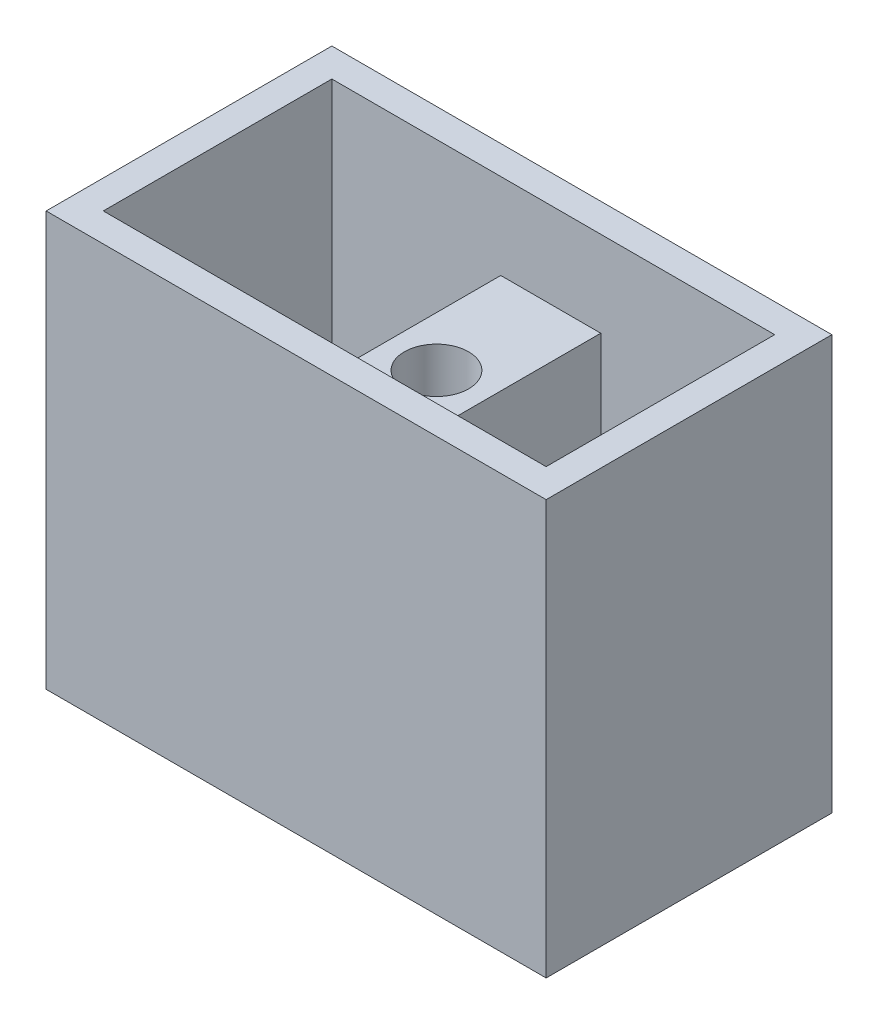
ISO-10303-21;
HEADER;
FILE_DESCRIPTION(('STEP AP214'),'2;1');
FILE_NAME('part.step','',(''),(''),'','','');
FILE_SCHEMA(('AUTOMOTIVE_DESIGN { 1 0 10303 214 1 1 1 1 }'));
ENDSEC;
DATA;
#1=APPLICATION_CONTEXT('core data for automotive mechanical design processes');
#2=APPLICATION_PROTOCOL_DEFINITION('international standard','automotive_design',2000,#1);
#3=PRODUCT_CONTEXT('',#1,'mechanical');
#4=PRODUCT('Part','Part','',(#3));
#5=PRODUCT_RELATED_PRODUCT_CATEGORY('part','',(#4));
#6=PRODUCT_DEFINITION_FORMATION('','',#4);
#7=PRODUCT_DEFINITION_CONTEXT('part definition',#1,'design');
#8=PRODUCT_DEFINITION('design','',#6,#7);
#9=PRODUCT_DEFINITION_SHAPE('','',#8);
#10=(LENGTH_UNIT() NAMED_UNIT(*) SI_UNIT(.MILLI.,.METRE.));
#11=(NAMED_UNIT(*) PLANE_ANGLE_UNIT() SI_UNIT($,.RADIAN.));
#12=(NAMED_UNIT(*) SI_UNIT($,.STERADIAN.) SOLID_ANGLE_UNIT());
#13=UNCERTAINTY_MEASURE_WITH_UNIT(LENGTH_MEASURE(1.E-05),#10,'distance_accuracy_value','');
#14=(GEOMETRIC_REPRESENTATION_CONTEXT(3) GLOBAL_UNCERTAINTY_ASSIGNED_CONTEXT((#13)) GLOBAL_UNIT_ASSIGNED_CONTEXT((#10,
#11,#12)) REPRESENTATION_CONTEXT('',''));
#15=CARTESIAN_POINT('',(0.,0.,0.));
#16=DIRECTION('',(0.,0.,1.));
#17=DIRECTION('',(1.,0.,0.));
#18=AXIS2_PLACEMENT_3D('',#15,#16,#17);
#19=CARTESIAN_POINT('',(69.1132816727556,0.,-90.));
#20=DIRECTION('',(1.,0.,0.));
#21=DIRECTION('',(0.,0.,-1.));
#22=AXIS2_PLACEMENT_3D('',#19,#20,#21);
#23=PLANE('',#22);
#24=DIRECTION('',(0.,0.,-1.));
#25=VECTOR('',#24,1.);
#26=CARTESIAN_POINT('',(69.1132816727556,30.,-10.));
#27=LINE('',#26,#25);
#28=CARTESIAN_POINT('',(69.1132816727556,30.,-10.));
#29=VERTEX_POINT('',#28);
#30=CARTESIAN_POINT('',(69.1132816727556,30.,-90.));
#31=VERTEX_POINT('',#30);
#32=EDGE_CURVE('E133',#29,#31,#27,.T.);
#33=ORIENTED_EDGE('',*,*,#32,.F.);
#34=DIRECTION('',(0.,1.,0.));
#35=VECTOR('',#34,1.);
#36=CARTESIAN_POINT('',(69.1132816727556,0.,-10.));
#37=LINE('',#36,#35);
#38=CARTESIAN_POINT('',(69.1132816727556,115.,-10.));
#39=VERTEX_POINT('',#38);
#40=EDGE_CURVE('E144',#29,#39,#37,.T.);
#41=ORIENTED_EDGE('',*,*,#40,.T.);
#42=DIRECTION('',(0.,0.,1.));
#43=VECTOR('',#42,1.);
#44=CARTESIAN_POINT('',(69.1132816727556,115.,-90.));
#45=LINE('',#44,#43);
#46=CARTESIAN_POINT('',(69.1132816727556,115.,-90.));
#47=VERTEX_POINT('',#46);
#48=EDGE_CURVE('E142',#47,#39,#45,.T.);
#49=ORIENTED_EDGE('',*,*,#48,.F.);
#50=DIRECTION('',(0.,1.,0.));
#51=VECTOR('',#50,1.);
#52=CARTESIAN_POINT('',(69.1132816727556,0.,-90.));
#53=LINE('',#52,#51);
#54=EDGE_CURVE('E127',#31,#47,#53,.T.);
#55=ORIENTED_EDGE('',*,*,#54,.F.);
#56=EDGE_LOOP('',(#33,#41,#49,#55));
#57=FACE_BOUND('',#56,.T.);
#58=ADVANCED_FACE('F33',(#57),#23,.F.);
#59=CARTESIAN_POINT('',(86.6132816727556,0.,-50.));
#60=DIRECTION('',(0.,1.,0.));
#61=DIRECTION('',(0.,0.,1.));
#62=AXIS2_PLACEMENT_3D('',#59,#60,#61);
#63=CYLINDRICAL_SURFACE('',#62,11.25);
#64=CARTESIAN_POINT('',(86.6132816727556,115.,-50.));
#65=DIRECTION('',(0.,1.,0.));
#66=DIRECTION('',(0.,0.,1.));
#67=AXIS2_PLACEMENT_3D('',#64,#65,#66);
#68=CIRCLE('',#67,11.25);
#69=CARTESIAN_POINT('',(86.6132816727556,115.,-38.75));
#70=VERTEX_POINT('',#69);
#71=EDGE_CURVE('E365',#70,#70,#68,.F.);
#72=ORIENTED_EDGE('',*,*,#71,.F.);
#73=EDGE_LOOP('',(#72));
#74=FACE_BOUND('',#73,.T.);
#75=CARTESIAN_POINT('',(86.6132816727556,30.,-50.));
#76=DIRECTION('',(0.,-1.,0.));
#77=DIRECTION('',(0.,0.,-1.));
#78=AXIS2_PLACEMENT_3D('',#75,#76,#77);
#79=CIRCLE('',#78,11.25);
#80=CARTESIAN_POINT('',(86.6132816727556,30.,-61.25));
#81=VERTEX_POINT('',#80);
#82=EDGE_CURVE('E353',#81,#81,#79,.F.);
#83=ORIENTED_EDGE('',*,*,#82,.F.);
#84=EDGE_LOOP('',(#83));
#85=FACE_BOUND('',#84,.T.);
#86=ADVANCED_FACE('F209',(#74,#85),#63,.F.);
#87=CARTESIAN_POINT('',(104.113281672756,0.,-90.));
#88=DIRECTION('',(-1.,0.,0.));
#89=DIRECTION('',(0.,0.,1.));
#90=AXIS2_PLACEMENT_3D('',#87,#88,#89);
#91=PLANE('',#90);
#92=DIRECTION('',(0.,0.,1.));
#93=VECTOR('',#92,1.);
#94=CARTESIAN_POINT('',(104.113281672756,30.,-10.));
#95=LINE('',#94,#93);
#96=CARTESIAN_POINT('',(104.113281672756,30.,-90.));
#97=VERTEX_POINT('',#96);
#98=CARTESIAN_POINT('',(104.113281672756,30.,-10.));
#99=VERTEX_POINT('',#98);
#100=EDGE_CURVE('E132',#97,#99,#95,.T.);
#101=ORIENTED_EDGE('',*,*,#100,.F.);
#102=DIRECTION('',(0.,1.,0.));
#103=VECTOR('',#102,1.);
#104=CARTESIAN_POINT('',(104.113281672756,0.,-90.));
#105=LINE('',#104,#103);
#106=CARTESIAN_POINT('',(104.113281672756,115.,-90.));
#107=VERTEX_POINT('',#106);
#108=EDGE_CURVE('E129',#97,#107,#105,.T.);
#109=ORIENTED_EDGE('',*,*,#108,.T.);
#110=DIRECTION('',(0.,0.,-1.));
#111=VECTOR('',#110,1.);
#112=CARTESIAN_POINT('',(104.113281672756,115.,-90.));
#113=LINE('',#112,#111);
#114=CARTESIAN_POINT('',(104.113281672756,115.,-10.));
#115=VERTEX_POINT('',#114);
#116=EDGE_CURVE('E361',#115,#107,#113,.T.);
#117=ORIENTED_EDGE('',*,*,#116,.F.);
#118=DIRECTION('',(0.,1.,0.));
#119=VECTOR('',#118,1.);
#120=CARTESIAN_POINT('',(104.113281672756,0.,-10.));
#121=LINE('',#120,#119);
#122=EDGE_CURVE('E53',#99,#115,#121,.T.);
#123=ORIENTED_EDGE('',*,*,#122,.F.);
#124=EDGE_LOOP('',(#101,#109,#117,#123));
#125=FACE_BOUND('',#124,.T.);
#126=ADVANCED_FACE('F207',(#125),#91,.F.);
#127=CARTESIAN_POINT('',(0.,145.,0.));
#128=DIRECTION('',(1.,0.,0.));
#129=DIRECTION('',(0.,0.,-1.));
#130=AXIS2_PLACEMENT_3D('',#127,#128,#129);
#131=PLANE('',#130);
#132=DIRECTION('',(0.,0.,1.));
#133=VECTOR('',#132,1.);
#134=CARTESIAN_POINT('',(0.,0.,0.));
#135=LINE('',#134,#133);
#136=CARTESIAN_POINT('',(0.,0.,-100.));
#137=VERTEX_POINT('',#136);
#138=CARTESIAN_POINT('',(0.,0.,0.));
#139=VERTEX_POINT('',#138);
#140=EDGE_CURVE('E143',#137,#139,#135,.T.);
#141=ORIENTED_EDGE('',*,*,#140,.T.);
#142=DIRECTION('',(0.,-1.,0.));
#143=VECTOR('',#142,1.);
#144=CARTESIAN_POINT('',(0.,145.,0.));
#145=LINE('',#144,#143);
#146=CARTESIAN_POINT('',(0.,145.,0.));
#147=VERTEX_POINT('',#146);
#148=EDGE_CURVE('E11',#147,#139,#145,.T.);
#149=ORIENTED_EDGE('',*,*,#148,.F.);
#150=DIRECTION('',(0.,0.,1.));
#151=VECTOR('',#150,1.);
#152=CARTESIAN_POINT('',(0.,145.,0.));
#153=LINE('',#152,#151);
#154=CARTESIAN_POINT('',(0.,145.,-100.));
#155=VERTEX_POINT('',#154);
#156=EDGE_CURVE('E160',#155,#147,#153,.T.);
#157=ORIENTED_EDGE('',*,*,#156,.F.);
#158=DIRECTION('',(0.,-1.,0.));
#159=VECTOR('',#158,1.);
#160=CARTESIAN_POINT('',(0.,145.,-100.));
#161=LINE('',#160,#159);
#162=EDGE_CURVE('E169',#155,#137,#161,.T.);
#163=ORIENTED_EDGE('',*,*,#162,.T.);
#164=EDGE_LOOP('',(#141,#149,#157,#163));
#165=FACE_BOUND('',#164,.T.);
#166=ADVANCED_FACE('F35',(#165),#131,.F.);
#167=CARTESIAN_POINT('',(0.,145.,0.));
#168=DIRECTION('',(0.,0.,-1.));
#169=DIRECTION('',(-1.,0.,0.));
#170=AXIS2_PLACEMENT_3D('',#167,#168,#169);
#171=PLANE('',#170);
#172=DIRECTION('',(1.,0.,0.));
#173=VECTOR('',#172,1.);
#174=CARTESIAN_POINT('',(0.,0.,0.));
#175=LINE('',#174,#173);
#176=CARTESIAN_POINT('',(175.,0.,0.));
#177=VERTEX_POINT('',#176);
#178=EDGE_CURVE('E147',#139,#177,#175,.T.);
#179=ORIENTED_EDGE('',*,*,#178,.T.);
#180=DIRECTION('',(0.,-1.,0.));
#181=VECTOR('',#180,1.);
#182=CARTESIAN_POINT('',(175.,145.,0.));
#183=LINE('',#182,#181);
#184=CARTESIAN_POINT('',(175.,145.,0.));
#185=VERTEX_POINT('',#184);
#186=EDGE_CURVE('E41',#185,#177,#183,.T.);
#187=ORIENTED_EDGE('',*,*,#186,.F.);
#188=DIRECTION('',(1.,0.,0.));
#189=VECTOR('',#188,1.);
#190=CARTESIAN_POINT('',(0.,145.,0.));
#191=LINE('',#190,#189);
#192=EDGE_CURVE('E163',#147,#185,#191,.T.);
#193=ORIENTED_EDGE('',*,*,#192,.F.);
#194=ORIENTED_EDGE('',*,*,#148,.T.);
#195=EDGE_LOOP('',(#179,#187,#193,#194));
#196=FACE_BOUND('',#195,.T.);
#197=ADVANCED_FACE('F200',(#196),#171,.F.);
#198=CARTESIAN_POINT('',(175.,145.,0.));
#199=DIRECTION('',(-1.,0.,0.));
#200=DIRECTION('',(0.,0.,1.));
#201=AXIS2_PLACEMENT_3D('',#198,#199,#200);
#202=PLANE('',#201);
#203=DIRECTION('',(0.,0.,-1.));
#204=VECTOR('',#203,1.);
#205=CARTESIAN_POINT('',(175.,0.,0.));
#206=LINE('',#205,#204);
#207=CARTESIAN_POINT('',(175.,0.,-100.));
#208=VERTEX_POINT('',#207);
#209=EDGE_CURVE('E172',#177,#208,#206,.T.);
#210=ORIENTED_EDGE('',*,*,#209,.T.);
#211=DIRECTION('',(0.,-1.,0.));
#212=VECTOR('',#211,1.);
#213=CARTESIAN_POINT('',(175.,145.,-100.));
#214=LINE('',#213,#212);
#215=CARTESIAN_POINT('',(175.,145.,-100.));
#216=VERTEX_POINT('',#215);
#217=EDGE_CURVE('E177',#216,#208,#214,.T.);
#218=ORIENTED_EDGE('',*,*,#217,.F.);
#219=DIRECTION('',(0.,0.,-1.));
#220=VECTOR('',#219,1.);
#221=CARTESIAN_POINT('',(175.,145.,0.));
#222=LINE('',#221,#220);
#223=EDGE_CURVE('E166',#185,#216,#222,.T.);
#224=ORIENTED_EDGE('',*,*,#223,.F.);
#225=ORIENTED_EDGE('',*,*,#186,.T.);
#226=EDGE_LOOP('',(#210,#218,#224,#225));
#227=FACE_BOUND('',#226,.T.);
#228=ADVANCED_FACE('F184',(#227),#202,.F.);
#229=CARTESIAN_POINT('',(0.,145.,-100.));
#230=DIRECTION('',(0.,0.,1.));
#231=DIRECTION('',(1.,0.,0.));
#232=AXIS2_PLACEMENT_3D('',#229,#230,#231);
#233=PLANE('',#232);
#234=DIRECTION('',(-1.,0.,0.));
#235=VECTOR('',#234,1.);
#236=CARTESIAN_POINT('',(0.,0.,-100.));
#237=LINE('',#236,#235);
#238=EDGE_CURVE('E164',#208,#137,#237,.T.);
#239=ORIENTED_EDGE('',*,*,#238,.T.);
#240=ORIENTED_EDGE('',*,*,#162,.F.);
#241=DIRECTION('',(-1.,0.,0.));
#242=VECTOR('',#241,1.);
#243=CARTESIAN_POINT('',(0.,145.,-100.));
#244=LINE('',#243,#242);
#245=EDGE_CURVE('E168',#216,#155,#244,.T.);
#246=ORIENTED_EDGE('',*,*,#245,.F.);
#247=ORIENTED_EDGE('',*,*,#217,.T.);
#248=EDGE_LOOP('',(#239,#240,#246,#247));
#249=FACE_BOUND('',#248,.T.);
#250=ADVANCED_FACE('F193',(#249),#233,.F.);
#251=CARTESIAN_POINT('',(0.,145.,0.));
#252=DIRECTION('',(0.,-1.,0.));
#253=DIRECTION('',(0.,0.,-1.));
#254=AXIS2_PLACEMENT_3D('',#251,#252,#253);
#255=PLANE('',#254);
#256=DIRECTION('',(-1.,0.,0.));
#257=VECTOR('',#256,1.);
#258=CARTESIAN_POINT('',(69.1132816727556,145.,-90.));
#259=LINE('',#258,#257);
#260=CARTESIAN_POINT('',(165.,145.,-90.));
#261=VERTEX_POINT('',#260);
#262=CARTESIAN_POINT('',(10.,145.,-90.));
#263=VERTEX_POINT('',#262);
#264=EDGE_CURVE('E377',#261,#263,#259,.T.);
#265=ORIENTED_EDGE('',*,*,#264,.F.);
#266=DIRECTION('',(0.,0.,-1.));
#267=VECTOR('',#266,1.);
#268=CARTESIAN_POINT('',(165.,145.,-10.));
#269=LINE('',#268,#267);
#270=CARTESIAN_POINT('',(165.,145.,-10.));
#271=VERTEX_POINT('',#270);
#272=EDGE_CURVE('E368',#271,#261,#269,.T.);
#273=ORIENTED_EDGE('',*,*,#272,.F.);
#274=DIRECTION('',(1.,0.,0.));
#275=VECTOR('',#274,1.);
#276=CARTESIAN_POINT('',(10.,145.,-10.));
#277=LINE('',#276,#275);
#278=CARTESIAN_POINT('',(10.,145.,-10.));
#279=VERTEX_POINT('',#278);
#280=EDGE_CURVE('E152',#279,#271,#277,.T.);
#281=ORIENTED_EDGE('',*,*,#280,.F.);
#282=DIRECTION('',(0.,0.,1.));
#283=VECTOR('',#282,1.);
#284=CARTESIAN_POINT('',(10.,145.,-90.));
#285=LINE('',#284,#283);
#286=EDGE_CURVE('E390',#263,#279,#285,.T.);
#287=ORIENTED_EDGE('',*,*,#286,.F.);
#288=EDGE_LOOP('',(#265,#273,#281,#287));
#289=FACE_BOUND('',#288,.T.);
#290=ORIENTED_EDGE('',*,*,#156,.T.);
#291=ORIENTED_EDGE('',*,*,#192,.T.);
#292=ORIENTED_EDGE('',*,*,#223,.T.);
#293=ORIENTED_EDGE('',*,*,#245,.T.);
#294=EDGE_LOOP('',(#290,#291,#292,#293));
#295=FACE_BOUND('',#294,.T.);
#296=ADVANCED_FACE('F199',(#289,#295),#255,.F.);
#297=CARTESIAN_POINT('',(0.,0.,0.));
#298=DIRECTION('',(0.,-1.,0.));
#299=DIRECTION('',(0.,0.,-1.));
#300=AXIS2_PLACEMENT_3D('',#297,#298,#299);
#301=PLANE('',#300);
#302=DIRECTION('',(1.,0.,0.));
#303=VECTOR('',#302,1.);
#304=CARTESIAN_POINT('',(10.,0.,-10.));
#305=LINE('',#304,#303);
#306=CARTESIAN_POINT('',(10.,0.,-10.));
#307=VERTEX_POINT('',#306);
#308=CARTESIAN_POINT('',(165.,0.,-10.));
#309=VERTEX_POINT('',#308);
#310=EDGE_CURVE('E159',#307,#309,#305,.T.);
#311=ORIENTED_EDGE('',*,*,#310,.T.);
#312=DIRECTION('',(0.,0.,-1.));
#313=VECTOR('',#312,1.);
#314=CARTESIAN_POINT('',(165.,0.,-10.));
#315=LINE('',#314,#313);
#316=CARTESIAN_POINT('',(165.,0.,-90.));
#317=VERTEX_POINT('',#316);
#318=EDGE_CURVE('E369',#309,#317,#315,.T.);
#319=ORIENTED_EDGE('',*,*,#318,.T.);
#320=DIRECTION('',(-1.,0.,0.));
#321=VECTOR('',#320,1.);
#322=CARTESIAN_POINT('',(69.1132816727556,0.,-90.));
#323=LINE('',#322,#321);
#324=CARTESIAN_POINT('',(10.,0.,-90.));
#325=VERTEX_POINT('',#324);
#326=EDGE_CURVE('E383',#317,#325,#323,.T.);
#327=ORIENTED_EDGE('',*,*,#326,.T.);
#328=DIRECTION('',(0.,0.,1.));
#329=VECTOR('',#328,1.);
#330=CARTESIAN_POINT('',(10.,0.,-90.));
#331=LINE('',#330,#329);
#332=EDGE_CURVE('E386',#325,#307,#331,.T.);
#333=ORIENTED_EDGE('',*,*,#332,.T.);
#334=EDGE_LOOP('',(#311,#319,#327,#333));
#335=FACE_BOUND('',#334,.T.);
#336=ORIENTED_EDGE('',*,*,#140,.F.);
#337=ORIENTED_EDGE('',*,*,#238,.F.);
#338=ORIENTED_EDGE('',*,*,#209,.F.);
#339=ORIENTED_EDGE('',*,*,#178,.F.);
#340=EDGE_LOOP('',(#336,#337,#338,#339));
#341=FACE_BOUND('',#340,.T.);
#342=ADVANCED_FACE('F190',(#335,#341),#301,.T.);
#343=CARTESIAN_POINT('',(69.1132816727556,0.,-90.));
#344=DIRECTION('',(0.,0.,-1.));
#345=DIRECTION('',(-1.,0.,0.));
#346=AXIS2_PLACEMENT_3D('',#343,#344,#345);
#347=PLANE('',#346);
#348=DIRECTION('',(1.,0.,0.));
#349=VECTOR('',#348,1.);
#350=CARTESIAN_POINT('',(69.1132816727556,30.,-90.));
#351=LINE('',#350,#349);
#352=EDGE_CURVE('E121',#31,#97,#351,.T.);
#353=ORIENTED_EDGE('',*,*,#352,.F.);
#354=ORIENTED_EDGE('',*,*,#54,.T.);
#355=DIRECTION('',(-1.,0.,0.));
#356=VECTOR('',#355,1.);
#357=CARTESIAN_POINT('',(69.1132816727556,115.,-90.));
#358=LINE('',#357,#356);
#359=EDGE_CURVE('E363',#107,#47,#358,.T.);
#360=ORIENTED_EDGE('',*,*,#359,.F.);
#361=ORIENTED_EDGE('',*,*,#108,.F.);
#362=EDGE_LOOP('',(#353,#354,#360,#361));
#363=FACE_BOUND('',#362,.T.);
#364=ORIENTED_EDGE('',*,*,#264,.T.);
#365=DIRECTION('',(0.,1.,0.));
#366=VECTOR('',#365,1.);
#367=CARTESIAN_POINT('',(10.,0.,-90.));
#368=LINE('',#367,#366);
#369=EDGE_CURVE('E156',#325,#263,#368,.T.);
#370=ORIENTED_EDGE('',*,*,#369,.F.);
#371=ORIENTED_EDGE('',*,*,#326,.F.);
#372=DIRECTION('',(0.,1.,0.));
#373=VECTOR('',#372,1.);
#374=CARTESIAN_POINT('',(165.,0.,-90.));
#375=LINE('',#374,#373);
#376=EDGE_CURVE('E374',#317,#261,#375,.T.);
#377=ORIENTED_EDGE('',*,*,#376,.T.);
#378=EDGE_LOOP('',(#364,#370,#371,#377));
#379=FACE_BOUND('',#378,.T.);
#380=ADVANCED_FACE('F123',(#363,#379),#347,.F.);
#381=CARTESIAN_POINT('',(10.,0.,-10.));
#382=DIRECTION('',(0.,0.,1.));
#383=DIRECTION('',(1.,0.,0.));
#384=AXIS2_PLACEMENT_3D('',#381,#382,#383);
#385=PLANE('',#384);
#386=ORIENTED_EDGE('',*,*,#40,.F.);
#387=DIRECTION('',(-1.,0.,0.));
#388=VECTOR('',#387,1.);
#389=CARTESIAN_POINT('',(69.1132816727556,30.,-10.));
#390=LINE('',#389,#388);
#391=EDGE_CURVE('E48',#99,#29,#390,.T.);
#392=ORIENTED_EDGE('',*,*,#391,.F.);
#393=ORIENTED_EDGE('',*,*,#122,.T.);
#394=DIRECTION('',(1.,0.,0.));
#395=VECTOR('',#394,1.);
#396=CARTESIAN_POINT('',(69.1132816727556,115.,-10.));
#397=LINE('',#396,#395);
#398=EDGE_CURVE('E359',#39,#115,#397,.T.);
#399=ORIENTED_EDGE('',*,*,#398,.F.);
#400=EDGE_LOOP('',(#386,#392,#393,#399));
#401=FACE_BOUND('',#400,.T.);
#402=ORIENTED_EDGE('',*,*,#280,.T.);
#403=DIRECTION('',(0.,1.,0.));
#404=VECTOR('',#403,1.);
#405=CARTESIAN_POINT('',(165.,0.,-10.));
#406=LINE('',#405,#404);
#407=EDGE_CURVE('E378',#309,#271,#406,.T.);
#408=ORIENTED_EDGE('',*,*,#407,.F.);
#409=ORIENTED_EDGE('',*,*,#310,.F.);
#410=DIRECTION('',(0.,1.,0.));
#411=VECTOR('',#410,1.);
#412=CARTESIAN_POINT('',(10.,0.,-10.));
#413=LINE('',#412,#411);
#414=EDGE_CURVE('E149',#307,#279,#413,.T.);
#415=ORIENTED_EDGE('',*,*,#414,.T.);
#416=EDGE_LOOP('',(#402,#408,#409,#415));
#417=FACE_BOUND('',#416,.T.);
#418=ADVANCED_FACE('F218',(#401,#417),#385,.F.);
#419=CARTESIAN_POINT('',(10.,0.,-90.));
#420=DIRECTION('',(-1.,0.,0.));
#421=DIRECTION('',(0.,0.,1.));
#422=AXIS2_PLACEMENT_3D('',#419,#420,#421);
#423=PLANE('',#422);
#424=ORIENTED_EDGE('',*,*,#286,.T.);
#425=ORIENTED_EDGE('',*,*,#414,.F.);
#426=ORIENTED_EDGE('',*,*,#332,.F.);
#427=ORIENTED_EDGE('',*,*,#369,.T.);
#428=EDGE_LOOP('',(#424,#425,#426,#427));
#429=FACE_BOUND('',#428,.T.);
#430=ADVANCED_FACE('F221',(#429),#423,.F.);
#431=CARTESIAN_POINT('',(165.,0.,-10.));
#432=DIRECTION('',(1.,0.,0.));
#433=DIRECTION('',(0.,0.,-1.));
#434=AXIS2_PLACEMENT_3D('',#431,#432,#433);
#435=PLANE('',#434);
#436=ORIENTED_EDGE('',*,*,#272,.T.);
#437=ORIENTED_EDGE('',*,*,#376,.F.);
#438=ORIENTED_EDGE('',*,*,#318,.F.);
#439=ORIENTED_EDGE('',*,*,#407,.T.);
#440=EDGE_LOOP('',(#436,#437,#438,#439));
#441=FACE_BOUND('',#440,.T.);
#442=ADVANCED_FACE('F224',(#441),#435,.F.);
#443=CARTESIAN_POINT('',(0.,115.,0.));
#444=DIRECTION('',(0.,1.,0.));
#445=DIRECTION('',(0.,0.,1.));
#446=AXIS2_PLACEMENT_3D('',#443,#444,#445);
#447=PLANE('',#446);
#448=ORIENTED_EDGE('',*,*,#48,.T.);
#449=ORIENTED_EDGE('',*,*,#398,.T.);
#450=ORIENTED_EDGE('',*,*,#116,.T.);
#451=ORIENTED_EDGE('',*,*,#359,.T.);
#452=EDGE_LOOP('',(#448,#449,#450,#451));
#453=FACE_BOUND('',#452,.T.);
#454=ORIENTED_EDGE('',*,*,#71,.T.);
#455=EDGE_LOOP('',(#454));
#456=FACE_BOUND('',#455,.T.);
#457=ADVANCED_FACE('F268',(#453,#456),#447,.T.);
#458=CARTESIAN_POINT('',(0.,30.,0.));
#459=DIRECTION('',(0.,-1.,0.));
#460=DIRECTION('',(0.,0.,-1.));
#461=AXIS2_PLACEMENT_3D('',#458,#459,#460);
#462=PLANE('',#461);
#463=ORIENTED_EDGE('',*,*,#32,.T.);
#464=ORIENTED_EDGE('',*,*,#352,.T.);
#465=ORIENTED_EDGE('',*,*,#100,.T.);
#466=ORIENTED_EDGE('',*,*,#391,.T.);
#467=EDGE_LOOP('',(#463,#464,#465,#466));
#468=FACE_BOUND('',#467,.T.);
#469=ORIENTED_EDGE('',*,*,#82,.T.);
#470=EDGE_LOOP('',(#469));
#471=FACE_BOUND('',#470,.T.);
#472=ADVANCED_FACE('F136',(#468,#471),#462,.T.);
#473=CLOSED_SHELL('',(#58,#86,#126,#166,#197,#228,#250,#296,#342,#380,#418,#430,#442,#457,#472));
#474=MANIFOLD_SOLID_BREP('B2',#473);
#475=ADVANCED_BREP_SHAPE_REPRESENTATION('',(#18,#474),#14);
#476=SHAPE_DEFINITION_REPRESENTATION(#9,#475);
ENDSEC;
END-ISO-10303-21;
